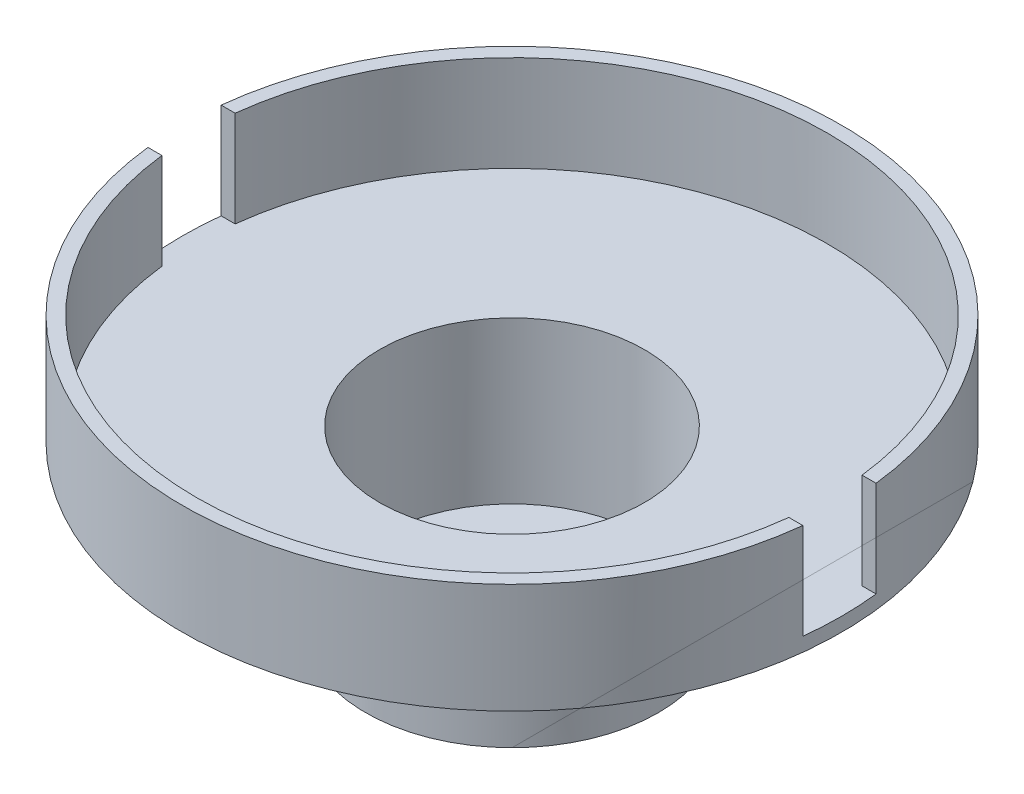
ISO-10303-21;
HEADER;
FILE_DESCRIPTION(('STEP AP214'),'2;1');
FILE_NAME('part.step','',(''),(''),'','','');
FILE_SCHEMA(('AUTOMOTIVE_DESIGN { 1 0 10303 214 1 1 1 1 }'));
ENDSEC;
DATA;
#1=APPLICATION_CONTEXT('core data for automotive mechanical design processes');
#2=APPLICATION_PROTOCOL_DEFINITION('international standard','automotive_design',2000,#1);
#3=PRODUCT_CONTEXT('',#1,'mechanical');
#4=PRODUCT('Part','Part','',(#3));
#5=PRODUCT_RELATED_PRODUCT_CATEGORY('part','',(#4));
#6=PRODUCT_DEFINITION_FORMATION('','',#4);
#7=PRODUCT_DEFINITION_CONTEXT('part definition',#1,'design');
#8=PRODUCT_DEFINITION('design','',#6,#7);
#9=PRODUCT_DEFINITION_SHAPE('','',#8);
#10=(LENGTH_UNIT() NAMED_UNIT(*) SI_UNIT(.MILLI.,.METRE.));
#11=(NAMED_UNIT(*) PLANE_ANGLE_UNIT() SI_UNIT($,.RADIAN.));
#12=(NAMED_UNIT(*) SI_UNIT($,.STERADIAN.) SOLID_ANGLE_UNIT());
#13=UNCERTAINTY_MEASURE_WITH_UNIT(LENGTH_MEASURE(1.E-05),#10,'distance_accuracy_value','');
#14=(GEOMETRIC_REPRESENTATION_CONTEXT(3) GLOBAL_UNCERTAINTY_ASSIGNED_CONTEXT((#13)) GLOBAL_UNIT_ASSIGNED_CONTEXT((#10,
#11,#12)) REPRESENTATION_CONTEXT('',''));
#15=CARTESIAN_POINT('',(0.,0.,0.));
#16=DIRECTION('',(0.,0.,1.));
#17=DIRECTION('',(1.,0.,0.));
#18=AXIS2_PLACEMENT_3D('',#15,#16,#17);
#19=CARTESIAN_POINT('',(7.07106781186548,-7.07106781186548,0.));
#20=DIRECTION('',(-0.707106781186547,0.707106781186548,0.));
#21=DIRECTION('',(-0.707106781186548,-0.707106781186547,0.));
#22=AXIS2_PLACEMENT_3D('',#19,#20,#21);
#23=PLANE('',#22);
#24=DIRECTION('',(0.,0.,1.));
#25=VECTOR('',#24,1.);
#26=CARTESIAN_POINT('',(14.142135623731,0.,0.));
#27=LINE('',#26,#25);
#28=CARTESIAN_POINT('',(14.142135623731,0.,-14.1421356237309));
#29=VERTEX_POINT('',#28);
#30=CARTESIAN_POINT('',(14.142135623731,0.,14.1421356237309));
#31=VERTEX_POINT('',#30);
#32=EDGE_CURVE('E81',#29,#31,#27,.T.);
#33=ORIENTED_EDGE('',*,*,#32,.T.);
#34=CARTESIAN_POINT('',(0.,-14.1421356237309,0.));
#35=DIRECTION('',(-0.707106781186547,0.707106781186548,0.));
#36=DIRECTION('',(-0.707106781186548,-0.707106781186547,0.));
#37=AXIS2_PLACEMENT_3D('',#34,#35,#36);
#38=ELLIPSE('',#37,28.2842712474619,20.);
#39=EDGE_CURVE('E85',#31,#29,#38,.T.);
#40=ORIENTED_EDGE('',*,*,#39,.T.);
#41=EDGE_LOOP('',(#33,#40));
#42=FACE_BOUND('',#41,.T.);
#43=CARTESIAN_POINT('',(0.,-14.1421356237309,0.));
#44=DIRECTION('',(-0.707106781186547,0.707106781186548,0.));
#45=DIRECTION('',(-0.707106781186548,-0.707106781186547,0.));
#46=AXIS2_PLACEMENT_3D('',#43,#44,#45);
#47=ELLIPSE('',#46,25.597265478953,18.1);
#48=CARTESIAN_POINT('',(16.042135623731,1.9,8.38211695395752));
#49=VERTEX_POINT('',#48);
#50=CARTESIAN_POINT('',(16.042135623731,1.9,-8.38211695395752));
#51=VERTEX_POINT('',#50);
#52=EDGE_CURVE('E88',#49,#51,#47,.T.);
#53=ORIENTED_EDGE('',*,*,#52,.F.);
#54=DIRECTION('',(0.,0.,1.));
#55=VECTOR('',#54,1.);
#56=CARTESIAN_POINT('',(16.042135623731,1.9,0.));
#57=LINE('',#56,#55);
#58=EDGE_CURVE('E57',#51,#49,#57,.T.);
#59=ORIENTED_EDGE('',*,*,#58,.F.);
#60=EDGE_LOOP('',(#53,#59));
#61=FACE_BOUND('',#60,.T.);
#62=ADVANCED_FACE('F53',(#42,#61),#23,.T.);
#63=CARTESIAN_POINT('',(0.,22.,0.));
#64=DIRECTION('',(0.,-1.,0.));
#65=DIRECTION('',(0.,0.,-1.));
#66=AXIS2_PLACEMENT_3D('',#63,#64,#65);
#67=CYLINDRICAL_SURFACE('',#66,18.1);
#68=CARTESIAN_POINT('',(0.,1.9,0.));
#69=DIRECTION('',(0.,1.,0.));
#70=DIRECTION('',(0.,0.,1.));
#71=AXIS2_PLACEMENT_3D('',#68,#69,#70);
#72=CIRCLE('',#71,18.1);
#73=EDGE_CURVE('E13',#49,#51,#72,.T.);
#74=ORIENTED_EDGE('',*,*,#73,.F.);
#75=ORIENTED_EDGE('',*,*,#52,.T.);
#76=EDGE_LOOP('',(#74,#75));
#77=FACE_BOUND('',#76,.T.);
#78=ADVANCED_FACE('F93',(#77),#67,.F.);
#79=CARTESIAN_POINT('',(0.,1.9,0.));
#80=DIRECTION('',(0.,1.,0.));
#81=DIRECTION('',(0.,0.,1.));
#82=AXIS2_PLACEMENT_3D('',#79,#80,#81);
#83=PLANE('',#82);
#84=ORIENTED_EDGE('',*,*,#73,.T.);
#85=ORIENTED_EDGE('',*,*,#58,.T.);
#86=EDGE_LOOP('',(#84,#85));
#87=FACE_BOUND('',#86,.T.);
#88=ADVANCED_FACE('F94',(#87),#83,.T.);
#89=CARTESIAN_POINT('',(0.,22.,0.));
#90=DIRECTION('',(0.,-1.,0.));
#91=DIRECTION('',(0.,0.,-1.));
#92=AXIS2_PLACEMENT_3D('',#89,#90,#91);
#93=CYLINDRICAL_SURFACE('',#92,20.);
#94=ORIENTED_EDGE('',*,*,#39,.F.);
#95=CARTESIAN_POINT('',(0.,0.,0.));
#96=DIRECTION('',(0.,1.,0.));
#97=DIRECTION('',(0.,0.,1.));
#98=AXIS2_PLACEMENT_3D('',#95,#96,#97);
#99=CIRCLE('',#98,20.);
#100=EDGE_CURVE('E62',#31,#29,#99,.T.);
#101=ORIENTED_EDGE('',*,*,#100,.T.);
#102=EDGE_LOOP('',(#94,#101));
#103=FACE_BOUND('',#102,.T.);
#104=ADVANCED_FACE('F86',(#103),#93,.T.);
#105=CARTESIAN_POINT('',(0.,0.,0.));
#106=DIRECTION('',(0.,1.,0.));
#107=DIRECTION('',(0.,0.,1.));
#108=AXIS2_PLACEMENT_3D('',#105,#106,#107);
#109=PLANE('',#108);
#110=ORIENTED_EDGE('',*,*,#32,.F.);
#111=ORIENTED_EDGE('',*,*,#100,.F.);
#112=EDGE_LOOP('',(#110,#111));
#113=FACE_BOUND('',#112,.T.);
#114=ADVANCED_FACE('F55',(#113),#109,.F.);
#115=CLOSED_SHELL('',(#62,#78,#88,#104,#114));
#116=MANIFOLD_SOLID_BREP('B2_NOT_SHOWN',#115);
#117=CARTESIAN_POINT('',(7.07106781186548,-7.07106781186548,0.));
#118=DIRECTION('',(-0.707106781186547,0.707106781186548,0.));
#119=DIRECTION('',(-0.707106781186548,-0.707106781186547,0.));
#120=AXIS2_PLACEMENT_3D('',#117,#118,#119);
#121=PLANE('',#120);
#122=CARTESIAN_POINT('',(0.,-14.1421356237309,0.));
#123=DIRECTION('',(-0.707106781186547,0.707106781186548,0.));
#124=DIRECTION('',(-0.707106781186548,-0.707106781186547,0.));
#125=AXIS2_PLACEMENT_3D('',#122,#123,#124);
#126=ELLIPSE('',#125,25.597265478953,18.1);
#127=CARTESIAN_POINT('',(16.042135623731,1.9,8.38211695395752));
#128=VERTEX_POINT('',#127);
#129=CARTESIAN_POINT('',(16.042135623731,1.9,-8.38211695395752));
#130=VERTEX_POINT('',#129);
#131=EDGE_CURVE('E283',#128,#130,#126,.T.);
#132=ORIENTED_EDGE('',*,*,#131,.T.);
#133=DIRECTION('',(0.,0.,1.));
#134=VECTOR('',#133,1.);
#135=CARTESIAN_POINT('',(16.042135623731,1.9,0.));
#136=LINE('',#135,#134);
#137=EDGE_CURVE('E147',#130,#128,#136,.T.);
#138=ORIENTED_EDGE('',*,*,#137,.T.);
#139=EDGE_LOOP('',(#132,#138));
#140=FACE_BOUND('',#139,.T.);
#141=DIRECTION('',(0.,0.,1.));
#142=VECTOR('',#141,1.);
#143=CARTESIAN_POINT('',(14.142135623731,0.,0.));
#144=LINE('',#143,#142);
#145=CARTESIAN_POINT('',(14.142135623731,0.,-14.1421356237309));
#146=VERTEX_POINT('',#145);
#147=CARTESIAN_POINT('',(14.142135623731,0.,14.1421356237309));
#148=VERTEX_POINT('',#147);
#149=EDGE_CURVE('E324',#146,#148,#144,.T.);
#150=ORIENTED_EDGE('',*,*,#149,.F.);
#151=CARTESIAN_POINT('',(0.,-14.1421356237309,0.));
#152=DIRECTION('',(-0.707106781186547,0.707106781186548,0.));
#153=DIRECTION('',(-0.707106781186548,-0.707106781186547,0.));
#154=AXIS2_PLACEMENT_3D('',#151,#152,#153);
#155=ELLIPSE('',#154,28.2842712474619,20.);
#156=EDGE_CURVE('E340',#148,#146,#155,.T.);
#157=ORIENTED_EDGE('',*,*,#156,.F.);
#158=EDGE_LOOP('',(#150,#157));
#159=FACE_BOUND('',#158,.T.);
#160=ADVANCED_FACE('F143',(#140,#159),#121,.F.);
#161=DIRECTION('',(-0.707106781186548,-0.707106781186547,0.));
#162=VECTOR('',#161,1.);
#163=CARTESIAN_POINT('',(-6.85077852069416,-20.9929141444251,-5.));
#164=LINE('',#163,#162);
#165=CARTESIAN_POINT('',(44.7213595499958,30.5792239262648,-5.));
#166=VERTEX_POINT('',#165);
#167=CARTESIAN_POINT('',(42.8089943820221,28.6668587582912,-5.));
#168=VERTEX_POINT('',#167);
#169=EDGE_CURVE('E257',#166,#168,#164,.T.);
#170=ORIENTED_EDGE('',*,*,#169,.T.);
#171=CARTESIAN_POINT('',(0.,-14.1421356237309,0.));
#172=DIRECTION('',(-0.707106781186547,0.707106781186548,0.));
#173=DIRECTION('',(-0.707106781186548,-0.707106781186547,0.));
#174=AXIS2_PLACEMENT_3D('',#171,#172,#173);
#175=ELLIPSE('',#174,60.9526045382804,43.1);
#176=CARTESIAN_POINT('',(38.042135623731,23.9,-20.2584776620964));
#177=VERTEX_POINT('',#176);
#178=EDGE_CURVE('E247',#168,#177,#175,.T.);
#179=ORIENTED_EDGE('',*,*,#178,.T.);
#180=DIRECTION('',(0.,0.,1.));
#181=VECTOR('',#180,1.);
#182=CARTESIAN_POINT('',(38.042135623731,23.9,0.));
#183=LINE('',#182,#181);
#184=CARTESIAN_POINT('',(38.042135623731,23.9,20.2584776620964));
#185=VERTEX_POINT('',#184);
#186=EDGE_CURVE('E289',#177,#185,#183,.T.);
#187=ORIENTED_EDGE('',*,*,#186,.T.);
#188=CARTESIAN_POINT('',(0.,-14.1421356237309,0.));
#189=DIRECTION('',(-0.707106781186547,0.707106781186548,0.));
#190=DIRECTION('',(-0.707106781186548,-0.707106781186547,0.));
#191=AXIS2_PLACEMENT_3D('',#188,#189,#190);
#192=ELLIPSE('',#191,60.9526045382804,43.1);
#193=CARTESIAN_POINT('',(42.8089943820221,28.6668587582912,5.));
#194=VERTEX_POINT('',#193);
#195=EDGE_CURVE('E254',#185,#194,#192,.T.);
#196=ORIENTED_EDGE('',*,*,#195,.T.);
#197=DIRECTION('',(0.707106781186548,0.707106781186547,0.));
#198=VECTOR('',#197,1.);
#199=CARTESIAN_POINT('',(-6.85077852069416,-20.9929141444251,5.));
#200=LINE('',#199,#198);
#201=CARTESIAN_POINT('',(44.7213595499958,30.5792239262648,5.));
#202=VERTEX_POINT('',#201);
#203=EDGE_CURVE('E250',#194,#202,#200,.T.);
#204=ORIENTED_EDGE('',*,*,#203,.T.);
#205=CARTESIAN_POINT('',(0.,-14.1421356237309,0.));
#206=DIRECTION('',(-0.707106781186547,0.707106781186548,0.));
#207=DIRECTION('',(-0.707106781186548,-0.707106781186547,0.));
#208=AXIS2_PLACEMENT_3D('',#205,#206,#207);
#209=ELLIPSE('',#208,63.6396103067893,45.);
#210=CARTESIAN_POINT('',(36.142135623731,22.,26.8094392435918));
#211=VERTEX_POINT('',#210);
#212=EDGE_CURVE('E235',#211,#202,#209,.T.);
#213=ORIENTED_EDGE('',*,*,#212,.F.);
#214=DIRECTION('',(0.,0.,1.));
#215=VECTOR('',#214,1.);
#216=CARTESIAN_POINT('',(36.142135623731,22.,0.));
#217=LINE('',#216,#215);
#218=CARTESIAN_POINT('',(36.142135623731,22.,-26.8094392435918));
#219=VERTEX_POINT('',#218);
#220=EDGE_CURVE('E323',#219,#211,#217,.T.);
#221=ORIENTED_EDGE('',*,*,#220,.F.);
#222=EDGE_CURVE('E246',#166,#219,#209,.T.);
#223=ORIENTED_EDGE('',*,*,#222,.F.);
#224=EDGE_LOOP('',(#170,#179,#187,#196,#204,#213,#221,#223));
#225=FACE_BOUND('',#224,.T.);
#226=ADVANCED_FACE('F252',(#225),#121,.F.);
#227=CARTESIAN_POINT('',(0.,22.,0.));
#228=DIRECTION('',(0.,-1.,0.));
#229=DIRECTION('',(0.,0.,-1.));
#230=AXIS2_PLACEMENT_3D('',#227,#228,#229);
#231=CYLINDRICAL_SURFACE('',#230,18.1);
#232=ORIENTED_EDGE('',*,*,#131,.F.);
#233=CARTESIAN_POINT('',(0.,1.9,0.));
#234=DIRECTION('',(0.,1.,0.));
#235=DIRECTION('',(0.,0.,1.));
#236=AXIS2_PLACEMENT_3D('',#233,#234,#235);
#237=CIRCLE('',#236,18.1);
#238=EDGE_CURVE('E274',#130,#128,#237,.T.);
#239=ORIENTED_EDGE('',*,*,#238,.F.);
#240=EDGE_LOOP('',(#232,#239));
#241=FACE_BOUND('',#240,.T.);
#242=CARTESIAN_POINT('',(0.,23.9,0.));
#243=DIRECTION('',(0.,1.,0.));
#244=DIRECTION('',(0.,0.,1.));
#245=AXIS2_PLACEMENT_3D('',#242,#243,#244);
#246=CIRCLE('',#245,18.1);
#247=CARTESIAN_POINT('',(0.,23.9,18.1));
#248=VERTEX_POINT('',#247);
#249=EDGE_CURVE('E278',#248,#248,#246,.T.);
#250=ORIENTED_EDGE('',*,*,#249,.T.);
#251=EDGE_LOOP('',(#250));
#252=FACE_BOUND('',#251,.T.);
#253=ADVANCED_FACE('F363',(#241,#252),#231,.F.);
#254=CARTESIAN_POINT('',(-64.8436926651192,37.,5.));
#255=DIRECTION('',(0.,0.,-1.));
#256=DIRECTION('',(-1.,0.,0.));
#257=AXIS2_PLACEMENT_3D('',#254,#255,#256);
#258=PLANE('',#257);
#259=DIRECTION('',(0.,-1.,0.));
#260=VECTOR('',#259,1.);
#261=CARTESIAN_POINT('',(-44.7213595499958,37.,5.));
#262=LINE('',#261,#260);
#263=CARTESIAN_POINT('',(-44.7213595499958,23.9,5.));
#264=VERTEX_POINT('',#263);
#265=CARTESIAN_POINT('',(-44.7213595499958,37.,5.));
#266=VERTEX_POINT('',#265);
#267=EDGE_CURVE('E166',#264,#266,#262,.F.);
#268=ORIENTED_EDGE('',*,*,#267,.T.);
#269=DIRECTION('',(1.,0.,0.));
#270=VECTOR('',#269,1.);
#271=CARTESIAN_POINT('',(-64.8436926651192,37.,5.));
#272=LINE('',#271,#270);
#273=CARTESIAN_POINT('',(-42.8089943820221,37.,5.));
#274=VERTEX_POINT('',#273);
#275=EDGE_CURVE('E319',#266,#274,#272,.T.);
#276=ORIENTED_EDGE('',*,*,#275,.T.);
#277=DIRECTION('',(0.,-1.,0.));
#278=VECTOR('',#277,1.);
#279=CARTESIAN_POINT('',(-42.8089943820221,37.,5.));
#280=LINE('',#279,#278);
#281=CARTESIAN_POINT('',(-42.8089943820221,23.9,5.));
#282=VERTEX_POINT('',#281);
#283=EDGE_CURVE('E271',#282,#274,#280,.F.);
#284=ORIENTED_EDGE('',*,*,#283,.F.);
#285=DIRECTION('',(1.,0.,0.));
#286=VECTOR('',#285,1.);
#287=CARTESIAN_POINT('',(-64.8436926651192,23.9,5.));
#288=LINE('',#287,#286);
#289=EDGE_CURVE('E152',#264,#282,#288,.T.);
#290=ORIENTED_EDGE('',*,*,#289,.F.);
#291=EDGE_LOOP('',(#268,#276,#284,#290));
#292=FACE_BOUND('',#291,.T.);
#293=ADVANCED_FACE('F381',(#292),#258,.T.);
#294=CARTESIAN_POINT('',(-64.8436926651192,37.,-5.));
#295=DIRECTION('',(0.,0.,1.));
#296=DIRECTION('',(1.,0.,0.));
#297=AXIS2_PLACEMENT_3D('',#294,#295,#296);
#298=PLANE('',#297);
#299=DIRECTION('',(0.,-1.,0.));
#300=VECTOR('',#299,1.);
#301=CARTESIAN_POINT('',(-44.7213595499958,37.,-5.));
#302=LINE('',#301,#300);
#303=CARTESIAN_POINT('',(-44.7213595499958,37.,-5.));
#304=VERTEX_POINT('',#303);
#305=CARTESIAN_POINT('',(-44.7213595499958,23.9,-5.));
#306=VERTEX_POINT('',#305);
#307=EDGE_CURVE('E301',#304,#306,#302,.T.);
#308=ORIENTED_EDGE('',*,*,#307,.T.);
#309=DIRECTION('',(-1.,0.,0.));
#310=VECTOR('',#309,1.);
#311=CARTESIAN_POINT('',(-64.8436926651192,23.9,-5.));
#312=LINE('',#311,#310);
#313=CARTESIAN_POINT('',(-42.8089943820221,23.9,-5.));
#314=VERTEX_POINT('',#313);
#315=EDGE_CURVE('E51',#314,#306,#312,.T.);
#316=ORIENTED_EDGE('',*,*,#315,.F.);
#317=DIRECTION('',(0.,-1.,0.));
#318=VECTOR('',#317,1.);
#319=CARTESIAN_POINT('',(-42.8089943820221,37.,-5.));
#320=LINE('',#319,#318);
#321=CARTESIAN_POINT('',(-42.8089943820221,37.,-5.));
#322=VERTEX_POINT('',#321);
#323=EDGE_CURVE('E266',#322,#314,#320,.T.);
#324=ORIENTED_EDGE('',*,*,#323,.F.);
#325=DIRECTION('',(-1.,0.,0.));
#326=VECTOR('',#325,1.);
#327=CARTESIAN_POINT('',(-64.8436926651192,37.,-5.));
#328=LINE('',#327,#326);
#329=EDGE_CURVE('E272',#322,#304,#328,.T.);
#330=ORIENTED_EDGE('',*,*,#329,.T.);
#331=EDGE_LOOP('',(#308,#316,#324,#330));
#332=FACE_BOUND('',#331,.T.);
#333=ADVANCED_FACE('F371',(#332),#298,.T.);
#334=CARTESIAN_POINT('',(0.,37.,0.));
#335=DIRECTION('',(0.,-1.,0.));
#336=DIRECTION('',(0.,0.,-1.));
#337=AXIS2_PLACEMENT_3D('',#334,#335,#336);
#338=CYLINDRICAL_SURFACE('',#337,43.1);
#339=ORIENTED_EDGE('',*,*,#178,.F.);
#340=DIRECTION('',(0.,-1.,0.));
#341=VECTOR('',#340,1.);
#342=CARTESIAN_POINT('',(42.8089943820221,37.,-5.));
#343=LINE('',#342,#341);
#344=CARTESIAN_POINT('',(42.8089943820221,37.,-5.));
#345=VERTEX_POINT('',#344);
#346=EDGE_CURVE('E262',#168,#345,#343,.F.);
#347=ORIENTED_EDGE('',*,*,#346,.T.);
#348=CARTESIAN_POINT('',(0.,37.,0.));
#349=DIRECTION('',(0.,1.,0.));
#350=DIRECTION('',(0.,0.,1.));
#351=AXIS2_PLACEMENT_3D('',#348,#349,#350);
#352=CIRCLE('',#351,43.1);
#353=EDGE_CURVE('E277',#345,#322,#352,.T.);
#354=ORIENTED_EDGE('',*,*,#353,.T.);
#355=ORIENTED_EDGE('',*,*,#323,.T.);
#356=CARTESIAN_POINT('',(0.,23.9,0.));
#357=DIRECTION('',(0.,1.,0.));
#358=DIRECTION('',(0.,0.,1.));
#359=AXIS2_PLACEMENT_3D('',#356,#357,#358);
#360=CIRCLE('',#359,43.1);
#361=EDGE_CURVE('E300',#177,#314,#360,.T.);
#362=ORIENTED_EDGE('',*,*,#361,.F.);
#363=EDGE_LOOP('',(#339,#347,#354,#355,#362));
#364=FACE_BOUND('',#363,.T.);
#365=ADVANCED_FACE('F328',(#364),#338,.F.);
#366=CARTESIAN_POINT('',(0.,37.,0.));
#367=DIRECTION('',(0.,1.,0.));
#368=DIRECTION('',(0.,0.,1.));
#369=AXIS2_PLACEMENT_3D('',#366,#367,#368);
#370=PLANE('',#369);
#371=CARTESIAN_POINT('',(0.,37.,0.));
#372=DIRECTION('',(0.,1.,0.));
#373=DIRECTION('',(0.,0.,1.));
#374=AXIS2_PLACEMENT_3D('',#371,#372,#373);
#375=CIRCLE('',#374,45.);
#376=CARTESIAN_POINT('',(44.7213595499958,37.,-5.));
#377=VERTEX_POINT('',#376);
#378=EDGE_CURVE('E281',#377,#304,#375,.T.);
#379=ORIENTED_EDGE('',*,*,#378,.T.);
#380=ORIENTED_EDGE('',*,*,#329,.F.);
#381=ORIENTED_EDGE('',*,*,#353,.F.);
#382=EDGE_CURVE('E321',#377,#345,#328,.T.);
#383=ORIENTED_EDGE('',*,*,#382,.F.);
#384=EDGE_LOOP('',(#379,#380,#381,#383));
#385=FACE_BOUND('',#384,.T.);
#386=ADVANCED_FACE('F370',(#385),#370,.T.);
#387=CARTESIAN_POINT('',(0.,37.,0.));
#388=DIRECTION('',(0.,-1.,0.));
#389=DIRECTION('',(0.,0.,-1.));
#390=AXIS2_PLACEMENT_3D('',#387,#388,#389);
#391=CYLINDRICAL_SURFACE('',#390,45.);
#392=CARTESIAN_POINT('',(0.,22.,0.));
#393=DIRECTION('',(0.,1.,0.));
#394=DIRECTION('',(0.,0.,1.));
#395=AXIS2_PLACEMENT_3D('',#392,#393,#394);
#396=CIRCLE('',#395,45.);
#397=EDGE_CURVE('E243',#219,#211,#396,.T.);
#398=ORIENTED_EDGE('',*,*,#397,.T.);
#399=ORIENTED_EDGE('',*,*,#212,.T.);
#400=DIRECTION('',(0.,-1.,0.));
#401=VECTOR('',#400,1.);
#402=CARTESIAN_POINT('',(44.7213595499958,37.,5.));
#403=LINE('',#402,#401);
#404=CARTESIAN_POINT('',(44.7213595499958,37.,5.));
#405=VERTEX_POINT('',#404);
#406=EDGE_CURVE('E240',#405,#202,#403,.T.);
#407=ORIENTED_EDGE('',*,*,#406,.F.);
#408=EDGE_CURVE('E297',#266,#405,#375,.T.);
#409=ORIENTED_EDGE('',*,*,#408,.F.);
#410=ORIENTED_EDGE('',*,*,#267,.F.);
#411=CARTESIAN_POINT('',(0.,23.9,0.));
#412=DIRECTION('',(0.,1.,0.));
#413=DIRECTION('',(0.,0.,1.));
#414=AXIS2_PLACEMENT_3D('',#411,#412,#413);
#415=CIRCLE('',#414,45.);
#416=EDGE_CURVE('E159',#306,#264,#415,.T.);
#417=ORIENTED_EDGE('',*,*,#416,.F.);
#418=ORIENTED_EDGE('',*,*,#307,.F.);
#419=ORIENTED_EDGE('',*,*,#378,.F.);
#420=DIRECTION('',(0.,-1.,0.));
#421=VECTOR('',#420,1.);
#422=CARTESIAN_POINT('',(44.7213595499958,37.,-5.));
#423=LINE('',#422,#421);
#424=EDGE_CURVE('E302',#166,#377,#423,.F.);
#425=ORIENTED_EDGE('',*,*,#424,.F.);
#426=ORIENTED_EDGE('',*,*,#222,.T.);
#427=EDGE_LOOP('',(#398,#399,#407,#409,#410,#417,#418,#419,#425,#426));
#428=FACE_BOUND('',#427,.T.);
#429=ADVANCED_FACE('F237',(#428),#391,.T.);
#430=ORIENTED_EDGE('',*,*,#408,.T.);
#431=CARTESIAN_POINT('',(42.8089943820221,37.,5.));
#432=VERTEX_POINT('',#431);
#433=EDGE_CURVE('E261',#432,#405,#272,.T.);
#434=ORIENTED_EDGE('',*,*,#433,.F.);
#435=EDGE_CURVE('E330',#274,#432,#352,.T.);
#436=ORIENTED_EDGE('',*,*,#435,.F.);
#437=ORIENTED_EDGE('',*,*,#275,.F.);
#438=EDGE_LOOP('',(#430,#434,#436,#437));
#439=FACE_BOUND('',#438,.T.);
#440=ADVANCED_FACE('F379',(#439),#370,.T.);
#441=ORIENTED_EDGE('',*,*,#195,.F.);
#442=EDGE_CURVE('E298',#282,#185,#360,.T.);
#443=ORIENTED_EDGE('',*,*,#442,.F.);
#444=ORIENTED_EDGE('',*,*,#283,.T.);
#445=ORIENTED_EDGE('',*,*,#435,.T.);
#446=DIRECTION('',(0.,-1.,0.));
#447=VECTOR('',#446,1.);
#448=CARTESIAN_POINT('',(42.8089943820221,37.,5.));
#449=LINE('',#448,#447);
#450=EDGE_CURVE('E264',#432,#194,#449,.T.);
#451=ORIENTED_EDGE('',*,*,#450,.T.);
#452=EDGE_LOOP('',(#441,#443,#444,#445,#451));
#453=FACE_BOUND('',#452,.T.);
#454=ADVANCED_FACE('F372',(#453),#338,.F.);
#455=ORIENTED_EDGE('',*,*,#203,.F.);
#456=ORIENTED_EDGE('',*,*,#450,.F.);
#457=ORIENTED_EDGE('',*,*,#433,.T.);
#458=ORIENTED_EDGE('',*,*,#406,.T.);
#459=EDGE_LOOP('',(#455,#456,#457,#458));
#460=FACE_BOUND('',#459,.T.);
#461=ADVANCED_FACE('F259',(#460),#258,.T.);
#462=ORIENTED_EDGE('',*,*,#169,.F.);
#463=ORIENTED_EDGE('',*,*,#424,.T.);
#464=ORIENTED_EDGE('',*,*,#382,.T.);
#465=ORIENTED_EDGE('',*,*,#346,.F.);
#466=EDGE_LOOP('',(#462,#463,#464,#465));
#467=FACE_BOUND('',#466,.T.);
#468=ADVANCED_FACE('F376',(#467),#298,.T.);
#469=CARTESIAN_POINT('',(0.,23.9,0.));
#470=DIRECTION('',(0.,1.,0.));
#471=DIRECTION('',(0.,0.,1.));
#472=AXIS2_PLACEMENT_3D('',#469,#470,#471);
#473=PLANE('',#472);
#474=ORIENTED_EDGE('',*,*,#186,.F.);
#475=ORIENTED_EDGE('',*,*,#361,.T.);
#476=ORIENTED_EDGE('',*,*,#315,.T.);
#477=ORIENTED_EDGE('',*,*,#416,.T.);
#478=ORIENTED_EDGE('',*,*,#289,.T.);
#479=ORIENTED_EDGE('',*,*,#442,.T.);
#480=EDGE_LOOP('',(#474,#475,#476,#477,#478,#479));
#481=FACE_BOUND('',#480,.T.);
#482=ORIENTED_EDGE('',*,*,#249,.F.);
#483=EDGE_LOOP('',(#482));
#484=FACE_BOUND('',#483,.T.);
#485=ADVANCED_FACE('F373',(#481,#484),#473,.T.);
#486=CARTESIAN_POINT('',(0.,1.9,0.));
#487=DIRECTION('',(0.,1.,0.));
#488=DIRECTION('',(0.,0.,1.));
#489=AXIS2_PLACEMENT_3D('',#486,#487,#488);
#490=PLANE('',#489);
#491=ORIENTED_EDGE('',*,*,#137,.F.);
#492=ORIENTED_EDGE('',*,*,#238,.T.);
#493=EDGE_LOOP('',(#491,#492));
#494=FACE_BOUND('',#493,.T.);
#495=ADVANCED_FACE('F355',(#494),#490,.T.);
#496=CARTESIAN_POINT('',(0.,22.,0.));
#497=DIRECTION('',(0.,-1.,0.));
#498=DIRECTION('',(0.,0.,-1.));
#499=AXIS2_PLACEMENT_3D('',#496,#497,#498);
#500=CYLINDRICAL_SURFACE('',#499,20.);
#501=CARTESIAN_POINT('',(0.,22.,0.));
#502=DIRECTION('',(0.,1.,0.));
#503=DIRECTION('',(0.,0.,1.));
#504=AXIS2_PLACEMENT_3D('',#501,#502,#503);
#505=CIRCLE('',#504,20.);
#506=CARTESIAN_POINT('',(0.,22.,20.));
#507=VERTEX_POINT('',#506);
#508=EDGE_CURVE('E282',#507,#507,#505,.T.);
#509=ORIENTED_EDGE('',*,*,#508,.F.);
#510=EDGE_LOOP('',(#509));
#511=FACE_BOUND('',#510,.T.);
#512=CARTESIAN_POINT('',(0.,0.,0.));
#513=DIRECTION('',(0.,1.,0.));
#514=DIRECTION('',(0.,0.,1.));
#515=AXIS2_PLACEMENT_3D('',#512,#513,#514);
#516=CIRCLE('',#515,20.);
#517=EDGE_CURVE('E279',#146,#148,#516,.T.);
#518=ORIENTED_EDGE('',*,*,#517,.T.);
#519=ORIENTED_EDGE('',*,*,#156,.T.);
#520=EDGE_LOOP('',(#518,#519));
#521=FACE_BOUND('',#520,.T.);
#522=ADVANCED_FACE('F347',(#511,#521),#500,.T.);
#523=CARTESIAN_POINT('',(0.,22.,0.));
#524=DIRECTION('',(0.,1.,0.));
#525=DIRECTION('',(0.,0.,1.));
#526=AXIS2_PLACEMENT_3D('',#523,#524,#525);
#527=PLANE('',#526);
#528=ORIENTED_EDGE('',*,*,#508,.T.);
#529=EDGE_LOOP('',(#528));
#530=FACE_BOUND('',#529,.T.);
#531=ORIENTED_EDGE('',*,*,#397,.F.);
#532=ORIENTED_EDGE('',*,*,#220,.T.);
#533=EDGE_LOOP('',(#531,#532));
#534=FACE_BOUND('',#533,.T.);
#535=ADVANCED_FACE('F145',(#530,#534),#527,.F.);
#536=CARTESIAN_POINT('',(0.,0.,0.));
#537=DIRECTION('',(0.,1.,0.));
#538=DIRECTION('',(0.,0.,1.));
#539=AXIS2_PLACEMENT_3D('',#536,#537,#538);
#540=PLANE('',#539);
#541=ORIENTED_EDGE('',*,*,#517,.F.);
#542=ORIENTED_EDGE('',*,*,#149,.T.);
#543=EDGE_LOOP('',(#541,#542));
#544=FACE_BOUND('',#543,.T.);
#545=ADVANCED_FACE('F346',(#544),#540,.F.);
#546=CLOSED_SHELL('',(#160,#226,#253,#293,#333,#365,#386,#429,#440,#454,#461,#468,#485,#495,
#522,#535,#545));
#547=MANIFOLD_SOLID_BREP('B7',#546);
#548=CARTESIAN_POINT('',(7.07106781186548,-7.07106781186548,0.));
#549=DIRECTION('',(-0.707106781186547,0.707106781186548,0.));
#550=DIRECTION('',(-0.707106781186548,-0.707106781186547,0.));
#551=AXIS2_PLACEMENT_3D('',#548,#549,#550);
#552=PLANE('',#551);
#553=DIRECTION('',(-0.707106781186548,-0.707106781186547,0.));
#554=VECTOR('',#553,1.);
#555=CARTESIAN_POINT('',(-6.85077852069416,-20.9929141444251,-5.));
#556=LINE('',#555,#554);
#557=CARTESIAN_POINT('',(44.7213595499958,30.5792239262648,-5.));
#558=VERTEX_POINT('',#557);
#559=CARTESIAN_POINT('',(42.8089943820221,28.6668587582912,-5.));
#560=VERTEX_POINT('',#559);
#561=EDGE_CURVE('E509',#558,#560,#556,.T.);
#562=ORIENTED_EDGE('',*,*,#561,.F.);
#563=CARTESIAN_POINT('',(0.,-14.1421356237309,0.));
#564=DIRECTION('',(-0.707106781186547,0.707106781186548,0.));
#565=DIRECTION('',(-0.707106781186548,-0.707106781186547,0.));
#566=AXIS2_PLACEMENT_3D('',#563,#564,#565);
#567=ELLIPSE('',#566,63.6396103067893,45.);
#568=CARTESIAN_POINT('',(36.142135623731,22.,-26.8094392435918));
#569=VERTEX_POINT('',#568);
#570=EDGE_CURVE('E514',#558,#569,#567,.T.);
#571=ORIENTED_EDGE('',*,*,#570,.T.);
#572=DIRECTION('',(0.,0.,1.));
#573=VECTOR('',#572,1.);
#574=CARTESIAN_POINT('',(36.142135623731,22.,0.));
#575=LINE('',#574,#573);
#576=CARTESIAN_POINT('',(36.142135623731,22.,26.8094392435918));
#577=VERTEX_POINT('',#576);
#578=EDGE_CURVE('E141',#569,#577,#575,.T.);
#579=ORIENTED_EDGE('',*,*,#578,.T.);
#580=CARTESIAN_POINT('',(44.7213595499958,30.5792239262648,5.));
#581=VERTEX_POINT('',#580);
#582=EDGE_CURVE('E600',#577,#581,#567,.T.);
#583=ORIENTED_EDGE('',*,*,#582,.T.);
#584=DIRECTION('',(0.707106781186548,0.707106781186547,0.));
#585=VECTOR('',#584,1.);
#586=CARTESIAN_POINT('',(-6.85077852069416,-20.9929141444251,5.));
#587=LINE('',#586,#585);
#588=CARTESIAN_POINT('',(42.8089943820221,28.6668587582912,5.));
#589=VERTEX_POINT('',#588);
#590=EDGE_CURVE('E595',#589,#581,#587,.T.);
#591=ORIENTED_EDGE('',*,*,#590,.F.);
#592=CARTESIAN_POINT('',(0.,-14.1421356237309,0.));
#593=DIRECTION('',(-0.707106781186547,0.707106781186548,0.));
#594=DIRECTION('',(-0.707106781186548,-0.707106781186547,0.));
#595=AXIS2_PLACEMENT_3D('',#592,#593,#594);
#596=ELLIPSE('',#595,60.9526045382804,43.1);
#597=CARTESIAN_POINT('',(38.042135623731,23.9,20.2584776620964));
#598=VERTEX_POINT('',#597);
#599=EDGE_CURVE('E576',#598,#589,#596,.T.);
#600=ORIENTED_EDGE('',*,*,#599,.F.);
#601=DIRECTION('',(0.,0.,1.));
#602=VECTOR('',#601,1.);
#603=CARTESIAN_POINT('',(38.042135623731,23.9,0.));
#604=LINE('',#603,#602);
#605=CARTESIAN_POINT('',(38.042135623731,23.9,-20.2584776620964));
#606=VERTEX_POINT('',#605);
#607=EDGE_CURVE('E566',#606,#598,#604,.T.);
#608=ORIENTED_EDGE('',*,*,#607,.F.);
#609=CARTESIAN_POINT('',(0.,-14.1421356237309,0.));
#610=DIRECTION('',(-0.707106781186547,0.707106781186548,0.));
#611=DIRECTION('',(-0.707106781186548,-0.707106781186547,0.));
#612=AXIS2_PLACEMENT_3D('',#609,#610,#611);
#613=ELLIPSE('',#612,60.9526045382804,43.1);
#614=EDGE_CURVE('E598',#560,#606,#613,.T.);
#615=ORIENTED_EDGE('',*,*,#614,.F.);
#616=EDGE_LOOP('',(#562,#571,#579,#583,#591,#600,#608,#615));
#617=FACE_BOUND('',#616,.T.);
#618=ADVANCED_FACE('F506',(#617),#552,.T.);
#619=CARTESIAN_POINT('',(0.,37.,0.));
#620=DIRECTION('',(0.,-1.,0.));
#621=DIRECTION('',(0.,0.,-1.));
#622=AXIS2_PLACEMENT_3D('',#619,#620,#621);
#623=CYLINDRICAL_SURFACE('',#622,43.1);
#624=DIRECTION('',(0.,-1.,0.));
#625=VECTOR('',#624,1.);
#626=CARTESIAN_POINT('',(42.8089943820221,37.,-5.));
#627=LINE('',#626,#625);
#628=CARTESIAN_POINT('',(42.8089943820221,23.9,-5.));
#629=VERTEX_POINT('',#628);
#630=EDGE_CURVE('E587',#629,#560,#627,.F.);
#631=ORIENTED_EDGE('',*,*,#630,.T.);
#632=ORIENTED_EDGE('',*,*,#614,.T.);
#633=CARTESIAN_POINT('',(0.,23.9,0.));
#634=DIRECTION('',(0.,1.,0.));
#635=DIRECTION('',(0.,0.,1.));
#636=AXIS2_PLACEMENT_3D('',#633,#634,#635);
#637=CIRCLE('',#636,43.1);
#638=EDGE_CURVE('E570',#629,#606,#637,.T.);
#639=ORIENTED_EDGE('',*,*,#638,.F.);
#640=EDGE_LOOP('',(#631,#632,#639));
#641=FACE_BOUND('',#640,.T.);
#642=ADVANCED_FACE('F613',(#641),#623,.F.);
#643=CARTESIAN_POINT('',(0.,23.9,0.));
#644=DIRECTION('',(0.,1.,0.));
#645=DIRECTION('',(0.,0.,1.));
#646=AXIS2_PLACEMENT_3D('',#643,#644,#645);
#647=PLANE('',#646);
#648=ORIENTED_EDGE('',*,*,#638,.T.);
#649=ORIENTED_EDGE('',*,*,#607,.T.);
#650=CARTESIAN_POINT('',(42.8089943820221,23.9,5.));
#651=VERTEX_POINT('',#650);
#652=EDGE_CURVE('E559',#598,#651,#637,.T.);
#653=ORIENTED_EDGE('',*,*,#652,.T.);
#654=DIRECTION('',(1.,0.,0.));
#655=VECTOR('',#654,1.);
#656=CARTESIAN_POINT('',(-64.8436926651192,23.9,5.));
#657=LINE('',#656,#655);
#658=CARTESIAN_POINT('',(44.7213595499958,23.9,5.));
#659=VERTEX_POINT('',#658);
#660=EDGE_CURVE('E564',#651,#659,#657,.T.);
#661=ORIENTED_EDGE('',*,*,#660,.T.);
#662=CARTESIAN_POINT('',(0.,23.9,0.));
#663=DIRECTION('',(0.,1.,0.));
#664=DIRECTION('',(0.,0.,1.));
#665=AXIS2_PLACEMENT_3D('',#662,#663,#664);
#666=CIRCLE('',#665,45.);
#667=CARTESIAN_POINT('',(44.7213595499958,23.9,-5.));
#668=VERTEX_POINT('',#667);
#669=EDGE_CURVE('E571',#659,#668,#666,.T.);
#670=ORIENTED_EDGE('',*,*,#669,.T.);
#671=DIRECTION('',(-1.,0.,0.));
#672=VECTOR('',#671,1.);
#673=CARTESIAN_POINT('',(-64.8436926651192,23.9,-5.));
#674=LINE('',#673,#672);
#675=EDGE_CURVE('E582',#668,#629,#674,.T.);
#676=ORIENTED_EDGE('',*,*,#675,.T.);
#677=EDGE_LOOP('',(#648,#649,#653,#661,#670,#676));
#678=FACE_BOUND('',#677,.T.);
#679=ADVANCED_FACE('F562',(#678),#647,.T.);
#680=CARTESIAN_POINT('',(0.,37.,0.));
#681=DIRECTION('',(0.,-1.,0.));
#682=DIRECTION('',(0.,0.,-1.));
#683=AXIS2_PLACEMENT_3D('',#680,#681,#682);
#684=CYLINDRICAL_SURFACE('',#683,45.);
#685=ORIENTED_EDGE('',*,*,#582,.F.);
#686=CARTESIAN_POINT('',(0.,22.,0.));
#687=DIRECTION('',(0.,1.,0.));
#688=DIRECTION('',(0.,0.,1.));
#689=AXIS2_PLACEMENT_3D('',#686,#687,#688);
#690=CIRCLE('',#689,45.);
#691=EDGE_CURVE('E521',#577,#569,#690,.T.);
#692=ORIENTED_EDGE('',*,*,#691,.T.);
#693=ORIENTED_EDGE('',*,*,#570,.F.);
#694=DIRECTION('',(0.,-1.,0.));
#695=VECTOR('',#694,1.);
#696=CARTESIAN_POINT('',(44.7213595499958,37.,-5.));
#697=LINE('',#696,#695);
#698=EDGE_CURVE('E590',#668,#558,#697,.F.);
#699=ORIENTED_EDGE('',*,*,#698,.F.);
#700=ORIENTED_EDGE('',*,*,#669,.F.);
#701=DIRECTION('',(0.,-1.,0.));
#702=VECTOR('',#701,1.);
#703=CARTESIAN_POINT('',(44.7213595499958,37.,5.));
#704=LINE('',#703,#702);
#705=EDGE_CURVE('E578',#581,#659,#704,.T.);
#706=ORIENTED_EDGE('',*,*,#705,.F.);
#707=EDGE_LOOP('',(#685,#692,#693,#699,#700,#706));
#708=FACE_BOUND('',#707,.T.);
#709=ADVANCED_FACE('F607',(#708),#684,.T.);
#710=ORIENTED_EDGE('',*,*,#652,.F.);
#711=ORIENTED_EDGE('',*,*,#599,.T.);
#712=DIRECTION('',(0.,-1.,0.));
#713=VECTOR('',#712,1.);
#714=CARTESIAN_POINT('',(42.8089943820221,37.,5.));
#715=LINE('',#714,#713);
#716=EDGE_CURVE('E574',#589,#651,#715,.T.);
#717=ORIENTED_EDGE('',*,*,#716,.T.);
#718=EDGE_LOOP('',(#710,#711,#717));
#719=FACE_BOUND('',#718,.T.);
#720=ADVANCED_FACE('F575',(#719),#623,.F.);
#721=CARTESIAN_POINT('',(-64.8436926651192,37.,5.));
#722=DIRECTION('',(0.,0.,-1.));
#723=DIRECTION('',(-1.,0.,0.));
#724=AXIS2_PLACEMENT_3D('',#721,#722,#723);
#725=PLANE('',#724);
#726=ORIENTED_EDGE('',*,*,#716,.F.);
#727=ORIENTED_EDGE('',*,*,#590,.T.);
#728=ORIENTED_EDGE('',*,*,#705,.T.);
#729=ORIENTED_EDGE('',*,*,#660,.F.);
#730=EDGE_LOOP('',(#726,#727,#728,#729));
#731=FACE_BOUND('',#730,.T.);
#732=ADVANCED_FACE('F580',(#731),#725,.T.);
#733=CARTESIAN_POINT('',(-64.8436926651192,37.,-5.));
#734=DIRECTION('',(0.,0.,1.));
#735=DIRECTION('',(1.,0.,0.));
#736=AXIS2_PLACEMENT_3D('',#733,#734,#735);
#737=PLANE('',#736);
#738=ORIENTED_EDGE('',*,*,#698,.T.);
#739=ORIENTED_EDGE('',*,*,#561,.T.);
#740=ORIENTED_EDGE('',*,*,#630,.F.);
#741=ORIENTED_EDGE('',*,*,#675,.F.);
#742=EDGE_LOOP('',(#738,#739,#740,#741));
#743=FACE_BOUND('',#742,.T.);
#744=ADVANCED_FACE('F612',(#743),#737,.T.);
#745=CARTESIAN_POINT('',(0.,22.,0.));
#746=DIRECTION('',(0.,1.,0.));
#747=DIRECTION('',(0.,0.,1.));
#748=AXIS2_PLACEMENT_3D('',#745,#746,#747);
#749=PLANE('',#748);
#750=ORIENTED_EDGE('',*,*,#578,.F.);
#751=ORIENTED_EDGE('',*,*,#691,.F.);
#752=EDGE_LOOP('',(#750,#751));
#753=FACE_BOUND('',#752,.T.);
#754=ADVANCED_FACE('F621',(#753),#749,.F.);
#755=CLOSED_SHELL('',(#618,#642,#679,#709,#720,#732,#744,#754));
#756=MANIFOLD_SOLID_BREP('B45_NOT_SHOWN',#755);
#757=ADVANCED_BREP_SHAPE_REPRESENTATION('',(#18,#116,#547,#756),#14);
#758=SHAPE_DEFINITION_REPRESENTATION(#9,#757);
ENDSEC;
END-ISO-10303-21;
